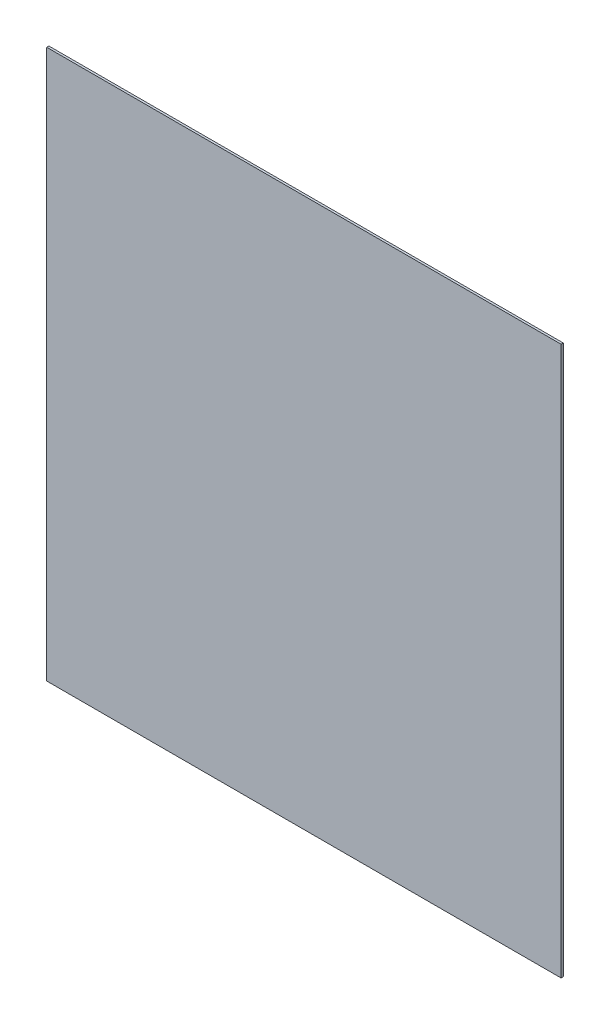
ISO-10303-21;
HEADER;
FILE_DESCRIPTION(('STEP AP214'),'2;1');
FILE_NAME('part.step','',(''),(''),'','','');
FILE_SCHEMA(('AUTOMOTIVE_DESIGN { 1 0 10303 214 1 1 1 1 }'));
ENDSEC;
DATA;
#1=APPLICATION_CONTEXT('core data for automotive mechanical design processes');
#2=APPLICATION_PROTOCOL_DEFINITION('international standard','automotive_design',2000,#1);
#3=PRODUCT_CONTEXT('',#1,'mechanical');
#4=PRODUCT('Part','Part','',(#3));
#5=PRODUCT_RELATED_PRODUCT_CATEGORY('part','',(#4));
#6=PRODUCT_DEFINITION_FORMATION('','',#4);
#7=PRODUCT_DEFINITION_CONTEXT('part definition',#1,'design');
#8=PRODUCT_DEFINITION('design','',#6,#7);
#9=PRODUCT_DEFINITION_SHAPE('','',#8);
#10=(LENGTH_UNIT() NAMED_UNIT(*) SI_UNIT(.MILLI.,.METRE.));
#11=(NAMED_UNIT(*) PLANE_ANGLE_UNIT() SI_UNIT($,.RADIAN.));
#12=(NAMED_UNIT(*) SI_UNIT($,.STERADIAN.) SOLID_ANGLE_UNIT());
#13=UNCERTAINTY_MEASURE_WITH_UNIT(LENGTH_MEASURE(1.E-05),#10,'distance_accuracy_value','');
#14=(GEOMETRIC_REPRESENTATION_CONTEXT(3) GLOBAL_UNCERTAINTY_ASSIGNED_CONTEXT((#13)) GLOBAL_UNIT_ASSIGNED_CONTEXT((#10,
#11,#12)) REPRESENTATION_CONTEXT('',''));
#15=CARTESIAN_POINT('',(0.,0.,0.));
#16=DIRECTION('',(0.,0.,1.));
#17=DIRECTION('',(1.,0.,0.));
#18=AXIS2_PLACEMENT_3D('',#15,#16,#17);
#19=CARTESIAN_POINT('',(372.5,397.5,3.175));
#20=DIRECTION('',(-1.,0.,0.));
#21=DIRECTION('',(0.,-1.,0.));
#22=AXIS2_PLACEMENT_3D('',#19,#20,#21);
#23=PLANE('',#22);
#24=DIRECTION('',(0.,1.,0.));
#25=VECTOR('',#24,1.);
#26=CARTESIAN_POINT('',(372.5,397.5,0.));
#27=LINE('',#26,#25);
#28=CARTESIAN_POINT('',(372.5,-397.5,0.));
#29=VERTEX_POINT('',#28);
#30=CARTESIAN_POINT('',(372.5,397.5,0.));
#31=VERTEX_POINT('',#30);
#32=EDGE_CURVE('E102',#29,#31,#27,.T.);
#33=ORIENTED_EDGE('',*,*,#32,.T.);
#34=DIRECTION('',(0.,0.,-1.));
#35=VECTOR('',#34,1.);
#36=CARTESIAN_POINT('',(372.5,397.5,3.175));
#37=LINE('',#36,#35);
#38=CARTESIAN_POINT('',(372.5,397.5,3.175));
#39=VERTEX_POINT('',#38);
#40=EDGE_CURVE('E11',#39,#31,#37,.T.);
#41=ORIENTED_EDGE('',*,*,#40,.F.);
#42=DIRECTION('',(0.,1.,0.));
#43=VECTOR('',#42,1.);
#44=CARTESIAN_POINT('',(372.5,397.5,3.175));
#45=LINE('',#44,#43);
#46=CARTESIAN_POINT('',(372.5,-397.5,3.175));
#47=VERTEX_POINT('',#46);
#48=EDGE_CURVE('E90',#47,#39,#45,.T.);
#49=ORIENTED_EDGE('',*,*,#48,.F.);
#50=DIRECTION('',(0.,0.,-1.));
#51=VECTOR('',#50,1.);
#52=CARTESIAN_POINT('',(372.5,-397.5,3.175));
#53=LINE('',#52,#51);
#54=EDGE_CURVE('E98',#47,#29,#53,.T.);
#55=ORIENTED_EDGE('',*,*,#54,.T.);
#56=EDGE_LOOP('',(#33,#41,#49,#55));
#57=FACE_BOUND('',#56,.T.);
#58=ADVANCED_FACE('F39',(#57),#23,.F.);
#59=CARTESIAN_POINT('',(-372.5,397.5,3.175));
#60=DIRECTION('',(0.,-1.,0.));
#61=DIRECTION('',(0.,0.,-1.));
#62=AXIS2_PLACEMENT_3D('',#59,#60,#61);
#63=PLANE('',#62);
#64=DIRECTION('',(-1.,0.,0.));
#65=VECTOR('',#64,1.);
#66=CARTESIAN_POINT('',(-372.5,397.5,0.));
#67=LINE('',#66,#65);
#68=CARTESIAN_POINT('',(-372.5,397.5,0.));
#69=VERTEX_POINT('',#68);
#70=EDGE_CURVE('E94',#31,#69,#67,.T.);
#71=ORIENTED_EDGE('',*,*,#70,.T.);
#72=DIRECTION('',(0.,0.,-1.));
#73=VECTOR('',#72,1.);
#74=CARTESIAN_POINT('',(-372.5,397.5,3.175));
#75=LINE('',#74,#73);
#76=CARTESIAN_POINT('',(-372.5,397.5,3.175));
#77=VERTEX_POINT('',#76);
#78=EDGE_CURVE('E47',#77,#69,#75,.T.);
#79=ORIENTED_EDGE('',*,*,#78,.F.);
#80=DIRECTION('',(-1.,0.,0.));
#81=VECTOR('',#80,1.);
#82=CARTESIAN_POINT('',(-372.5,397.5,3.175));
#83=LINE('',#82,#81);
#84=EDGE_CURVE('E85',#39,#77,#83,.T.);
#85=ORIENTED_EDGE('',*,*,#84,.F.);
#86=ORIENTED_EDGE('',*,*,#40,.T.);
#87=EDGE_LOOP('',(#71,#79,#85,#86));
#88=FACE_BOUND('',#87,.T.);
#89=ADVANCED_FACE('F93',(#88),#63,.F.);
#90=CARTESIAN_POINT('',(-372.5,397.5,3.175));
#91=DIRECTION('',(1.,0.,0.));
#92=DIRECTION('',(0.,1.,0.));
#93=AXIS2_PLACEMENT_3D('',#90,#91,#92);
#94=PLANE('',#93);
#95=DIRECTION('',(0.,-1.,0.));
#96=VECTOR('',#95,1.);
#97=CARTESIAN_POINT('',(-372.5,397.5,0.));
#98=LINE('',#97,#96);
#99=CARTESIAN_POINT('',(-372.5,-397.5,0.));
#100=VERTEX_POINT('',#99);
#101=EDGE_CURVE('E72',#69,#100,#98,.T.);
#102=ORIENTED_EDGE('',*,*,#101,.T.);
#103=DIRECTION('',(0.,0.,-1.));
#104=VECTOR('',#103,1.);
#105=CARTESIAN_POINT('',(-372.5,-397.5,3.175));
#106=LINE('',#105,#104);
#107=CARTESIAN_POINT('',(-372.5,-397.5,3.175));
#108=VERTEX_POINT('',#107);
#109=EDGE_CURVE('E95',#108,#100,#106,.T.);
#110=ORIENTED_EDGE('',*,*,#109,.F.);
#111=DIRECTION('',(0.,-1.,0.));
#112=VECTOR('',#111,1.);
#113=CARTESIAN_POINT('',(-372.5,397.5,3.175));
#114=LINE('',#113,#112);
#115=EDGE_CURVE('E88',#77,#108,#114,.T.);
#116=ORIENTED_EDGE('',*,*,#115,.F.);
#117=ORIENTED_EDGE('',*,*,#78,.T.);
#118=EDGE_LOOP('',(#102,#110,#116,#117));
#119=FACE_BOUND('',#118,.T.);
#120=ADVANCED_FACE('F96',(#119),#94,.F.);
#121=CARTESIAN_POINT('',(-372.5,-397.5,3.175));
#122=DIRECTION('',(0.,1.,0.));
#123=DIRECTION('',(0.,0.,1.));
#124=AXIS2_PLACEMENT_3D('',#121,#122,#123);
#125=PLANE('',#124);
#126=DIRECTION('',(1.,0.,0.));
#127=VECTOR('',#126,1.);
#128=CARTESIAN_POINT('',(-372.5,-397.5,0.));
#129=LINE('',#128,#127);
#130=EDGE_CURVE('E78',#100,#29,#129,.T.);
#131=ORIENTED_EDGE('',*,*,#130,.T.);
#132=ORIENTED_EDGE('',*,*,#54,.F.);
#133=DIRECTION('',(1.,0.,0.));
#134=VECTOR('',#133,1.);
#135=CARTESIAN_POINT('',(-372.5,-397.5,3.175));
#136=LINE('',#135,#134);
#137=EDGE_CURVE('E55',#108,#47,#136,.T.);
#138=ORIENTED_EDGE('',*,*,#137,.F.);
#139=ORIENTED_EDGE('',*,*,#109,.T.);
#140=EDGE_LOOP('',(#131,#132,#138,#139));
#141=FACE_BOUND('',#140,.T.);
#142=ADVANCED_FACE('F109',(#141),#125,.F.);
#143=CARTESIAN_POINT('',(0.,0.,3.175));
#144=DIRECTION('',(0.,0.,1.));
#145=DIRECTION('',(1.,0.,0.));
#146=AXIS2_PLACEMENT_3D('',#143,#144,#145);
#147=PLANE('',#146);
#148=ORIENTED_EDGE('',*,*,#48,.T.);
#149=ORIENTED_EDGE('',*,*,#84,.T.);
#150=ORIENTED_EDGE('',*,*,#115,.T.);
#151=ORIENTED_EDGE('',*,*,#137,.T.);
#152=EDGE_LOOP('',(#148,#149,#150,#151));
#153=FACE_BOUND('',#152,.T.);
#154=ADVANCED_FACE('F86',(#153),#147,.T.);
#155=CARTESIAN_POINT('',(0.,0.,0.));
#156=DIRECTION('',(0.,0.,1.));
#157=DIRECTION('',(1.,0.,0.));
#158=AXIS2_PLACEMENT_3D('',#155,#156,#157);
#159=PLANE('',#158);
#160=ORIENTED_EDGE('',*,*,#32,.F.);
#161=ORIENTED_EDGE('',*,*,#130,.F.);
#162=ORIENTED_EDGE('',*,*,#101,.F.);
#163=ORIENTED_EDGE('',*,*,#70,.F.);
#164=EDGE_LOOP('',(#160,#161,#162,#163));
#165=FACE_BOUND('',#164,.T.);
#166=ADVANCED_FACE('F112',(#165),#159,.F.);
#167=CLOSED_SHELL('',(#58,#89,#120,#142,#154,#166));
#168=MANIFOLD_SOLID_BREP('B2',#167);
#169=ADVANCED_BREP_SHAPE_REPRESENTATION('',(#18,#168),#14);
#170=SHAPE_DEFINITION_REPRESENTATION(#9,#169);
ENDSEC;
END-ISO-10303-21;
